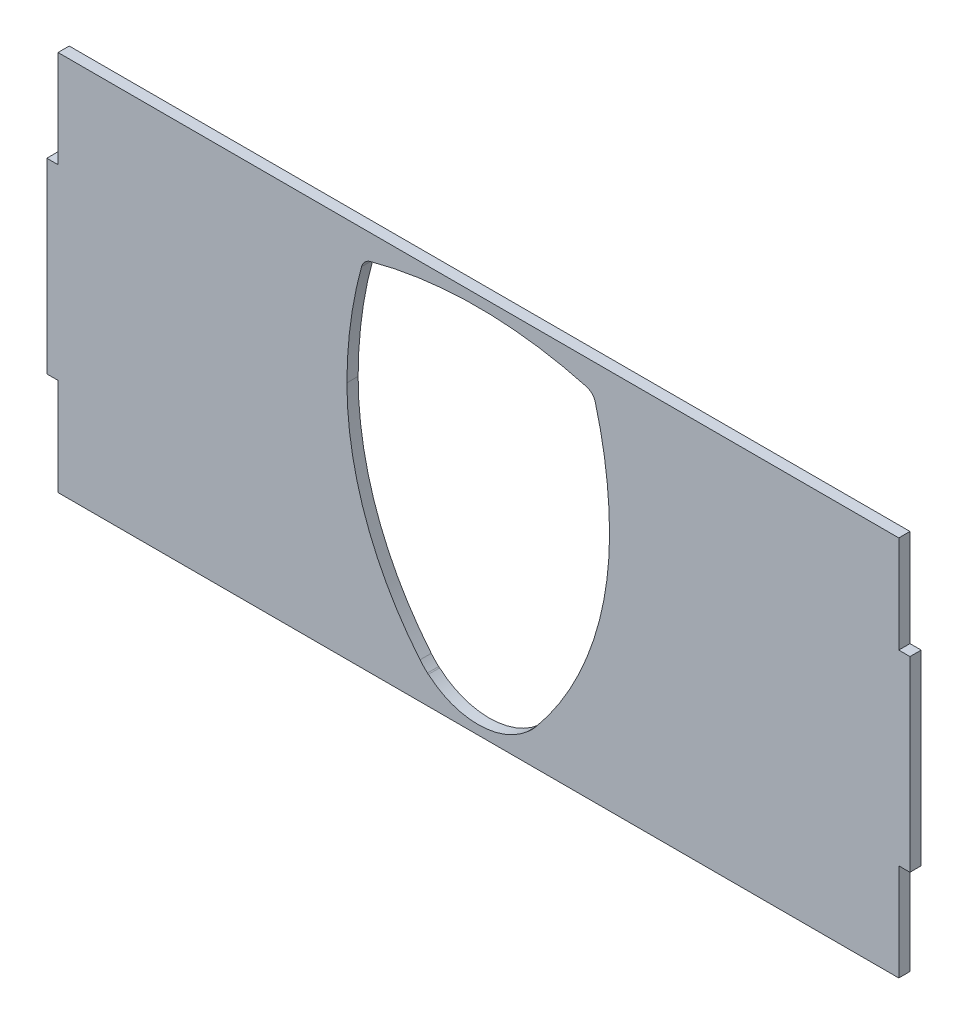
ISO-10303-21;
HEADER;
FILE_DESCRIPTION(('STEP AP214'),'2;1');
FILE_NAME('part.step','',(''),(''),'','','');
FILE_SCHEMA(('AUTOMOTIVE_DESIGN { 1 0 10303 214 1 1 1 1 }'));
ENDSEC;
DATA;
#1=APPLICATION_CONTEXT('core data for automotive mechanical design processes');
#2=APPLICATION_PROTOCOL_DEFINITION('international standard','automotive_design',2000,#1);
#3=PRODUCT_CONTEXT('',#1,'mechanical');
#4=PRODUCT('Part','Part','',(#3));
#5=PRODUCT_RELATED_PRODUCT_CATEGORY('part','',(#4));
#6=PRODUCT_DEFINITION_FORMATION('','',#4);
#7=PRODUCT_DEFINITION_CONTEXT('part definition',#1,'design');
#8=PRODUCT_DEFINITION('design','',#6,#7);
#9=PRODUCT_DEFINITION_SHAPE('','',#8);
#10=(LENGTH_UNIT() NAMED_UNIT(*) SI_UNIT(.MILLI.,.METRE.));
#11=(NAMED_UNIT(*) PLANE_ANGLE_UNIT() SI_UNIT($,.RADIAN.));
#12=(NAMED_UNIT(*) SI_UNIT($,.STERADIAN.) SOLID_ANGLE_UNIT());
#13=UNCERTAINTY_MEASURE_WITH_UNIT(LENGTH_MEASURE(1.E-05),#10,'distance_accuracy_value','');
#14=(GEOMETRIC_REPRESENTATION_CONTEXT(3) GLOBAL_UNCERTAINTY_ASSIGNED_CONTEXT((#13)) GLOBAL_UNIT_ASSIGNED_CONTEXT((#10,
#11,#12)) REPRESENTATION_CONTEXT('',''));
#15=CARTESIAN_POINT('',(0.,0.,0.));
#16=DIRECTION('',(0.,0.,1.));
#17=DIRECTION('',(1.,0.,0.));
#18=AXIS2_PLACEMENT_3D('',#15,#16,#17);
#19=CARTESIAN_POINT('',(0.,0.,3.));
#20=DIRECTION('',(0.,0.,1.));
#21=DIRECTION('',(1.,0.,0.));
#22=AXIS2_PLACEMENT_3D('',#19,#20,#21);
#23=PLANE('',#22);
#24=DIRECTION('',(-1.,0.,0.));
#25=VECTOR('',#24,1.);
#26=CARTESIAN_POINT('',(112.657319819799,49.5841216216235,3.));
#27=LINE('',#26,#25);
#28=CARTESIAN_POINT('',(112.657319819799,49.5841216216235,3.));
#29=VERTEX_POINT('',#28);
#30=CARTESIAN_POINT('',(-112.342680180183,49.5841216216235,3.));
#31=VERTEX_POINT('',#30);
#32=EDGE_CURVE('E290',#29,#31,#27,.T.);
#33=ORIENTED_EDGE('',*,*,#32,.T.);
#34=DIRECTION('',(0.,-1.,0.));
#35=VECTOR('',#34,1.);
#36=CARTESIAN_POINT('',(-112.342680180183,49.5841216216235,3.));
#37=LINE('',#36,#35);
#38=CARTESIAN_POINT('',(-112.342680180183,23.5841216216234,3.));
#39=VERTEX_POINT('',#38);
#40=EDGE_CURVE('E293',#31,#39,#37,.T.);
#41=ORIENTED_EDGE('',*,*,#40,.T.);
#42=DIRECTION('',(-1.,0.,0.));
#43=VECTOR('',#42,1.);
#44=CARTESIAN_POINT('',(-112.342680180183,23.5841216216234,3.));
#45=LINE('',#44,#43);
#46=CARTESIAN_POINT('',(-115.342680180183,23.5841216216234,3.));
#47=VERTEX_POINT('',#46);
#48=EDGE_CURVE('E296',#39,#47,#45,.T.);
#49=ORIENTED_EDGE('',*,*,#48,.T.);
#50=DIRECTION('',(0.,-1.,0.));
#51=VECTOR('',#50,1.);
#52=CARTESIAN_POINT('',(-115.342680180183,23.5841216216234,3.));
#53=LINE('',#52,#51);
#54=CARTESIAN_POINT('',(-115.342680180183,-26.4158783783766,3.));
#55=VERTEX_POINT('',#54);
#56=EDGE_CURVE('E298',#47,#55,#53,.T.);
#57=ORIENTED_EDGE('',*,*,#56,.T.);
#58=DIRECTION('',(1.,0.,0.));
#59=VECTOR('',#58,1.);
#60=CARTESIAN_POINT('',(-115.342680180183,-26.4158783783766,3.));
#61=LINE('',#60,#59);
#62=CARTESIAN_POINT('',(-112.342680180183,-26.4158783783766,3.));
#63=VERTEX_POINT('',#62);
#64=EDGE_CURVE('E300',#55,#63,#61,.T.);
#65=ORIENTED_EDGE('',*,*,#64,.T.);
#66=DIRECTION('',(0.,-1.,0.));
#67=VECTOR('',#66,1.);
#68=CARTESIAN_POINT('',(-112.342680180183,-26.4158783783766,3.));
#69=LINE('',#68,#67);
#70=CARTESIAN_POINT('',(-112.342680180183,-52.4158783783766,3.));
#71=VERTEX_POINT('',#70);
#72=EDGE_CURVE('E302',#63,#71,#69,.T.);
#73=ORIENTED_EDGE('',*,*,#72,.T.);
#74=DIRECTION('',(1.,0.,0.));
#75=VECTOR('',#74,1.);
#76=CARTESIAN_POINT('',(-112.342680180183,-52.4158783783766,3.));
#77=LINE('',#76,#75);
#78=CARTESIAN_POINT('',(112.657319819799,-52.4158783783766,3.));
#79=VERTEX_POINT('',#78);
#80=EDGE_CURVE('E304',#71,#79,#77,.T.);
#81=ORIENTED_EDGE('',*,*,#80,.T.);
#82=DIRECTION('',(0.,1.,0.));
#83=VECTOR('',#82,1.);
#84=CARTESIAN_POINT('',(112.657319819799,-52.4158783783766,3.));
#85=LINE('',#84,#83);
#86=CARTESIAN_POINT('',(112.657319819799,-26.4158783783766,3.));
#87=VERTEX_POINT('',#86);
#88=EDGE_CURVE('E306',#79,#87,#85,.T.);
#89=ORIENTED_EDGE('',*,*,#88,.T.);
#90=DIRECTION('',(1.,0.,0.));
#91=VECTOR('',#90,1.);
#92=CARTESIAN_POINT('',(112.657319819799,-26.4158783783766,3.));
#93=LINE('',#92,#91);
#94=CARTESIAN_POINT('',(115.657319819799,-26.4158783783766,3.));
#95=VERTEX_POINT('',#94);
#96=EDGE_CURVE('E308',#87,#95,#93,.T.);
#97=ORIENTED_EDGE('',*,*,#96,.T.);
#98=DIRECTION('',(0.,1.,0.));
#99=VECTOR('',#98,1.);
#100=CARTESIAN_POINT('',(115.657319819799,-26.4158783783766,3.));
#101=LINE('',#100,#99);
#102=CARTESIAN_POINT('',(115.657319819799,23.5841216216234,3.));
#103=VERTEX_POINT('',#102);
#104=EDGE_CURVE('E310',#95,#103,#101,.T.);
#105=ORIENTED_EDGE('',*,*,#104,.T.);
#106=DIRECTION('',(-1.,0.,0.));
#107=VECTOR('',#106,1.);
#108=CARTESIAN_POINT('',(115.657319819799,23.5841216216234,3.));
#109=LINE('',#108,#107);
#110=CARTESIAN_POINT('',(112.657319819799,23.5841216216234,3.));
#111=VERTEX_POINT('',#110);
#112=EDGE_CURVE('E312',#103,#111,#109,.T.);
#113=ORIENTED_EDGE('',*,*,#112,.T.);
#114=DIRECTION('',(0.,1.,0.));
#115=VECTOR('',#114,1.);
#116=CARTESIAN_POINT('',(112.657319819799,23.5841216216234,3.));
#117=LINE('',#116,#115);
#118=EDGE_CURVE('E314',#111,#29,#117,.T.);
#119=ORIENTED_EDGE('',*,*,#118,.T.);
#120=EDGE_LOOP('',(#33,#41,#49,#57,#65,#73,#81,#89,#97,#105,#113,#119));
#121=FACE_BOUND('',#120,.T.);
#122=CARTESIAN_POINT('',(-27.844748790696,39.6685860086391,3.));
#123=DIRECTION('',(0.,0.,1.));
#124=DIRECTION('',(1.,0.,0.));
#125=AXIS2_PLACEMENT_3D('',#122,#123,#124);
#126=CIRCLE('',#125,3.39034499368492);
#127=CARTESIAN_POINT('',(-28.7319405351346,42.9407916844492,3.));
#128=VERTEX_POINT('',#127);
#129=CARTESIAN_POINT('',(-31.1142632918185,40.5656445926535,3.));
#130=VERTEX_POINT('',#129);
#131=EDGE_CURVE('E219',#128,#130,#126,.T.);
#132=ORIENTED_EDGE('',*,*,#131,.F.);
#133=CARTESIAN_POINT('',(0.000380552190612374,-63.0318627475461,3.));
#134=DIRECTION('',(0.,0.,1.));
#135=DIRECTION('',(1.,0.,0.));
#136=AXIS2_PLACEMENT_3D('',#133,#134,#135);
#137=CIRCLE('',#136,109.798678327329);
#138=CARTESIAN_POINT('',(29.0522460947758,42.853636122336,3.));
#139=VERTEX_POINT('',#138);
#140=EDGE_CURVE('E211',#139,#128,#137,.T.);
#141=ORIENTED_EDGE('',*,*,#140,.F.);
#142=CARTESIAN_POINT('',(28.1551875107582,39.5841216212024,3.));
#143=DIRECTION('',(0.,0.,1.));
#144=DIRECTION('',(1.,0.,0.));
#145=AXIS2_PLACEMENT_3D('',#142,#143,#144);
#146=CIRCLE('',#145,3.39034499369649);
#147=CARTESIAN_POINT('',(31.4273931865795,40.4713133656441,3.));
#148=VERTEX_POINT('',#147);
#149=EDGE_CURVE('E493',#148,#139,#146,.T.);
#150=ORIENTED_EDGE('',*,*,#149,.F.);
#151=CARTESIAN_POINT('',(-74.5452612448646,11.7389922784686,3.));
#152=DIRECTION('',(0.,0.,1.));
#153=DIRECTION('',(1.,0.,0.));
#154=AXIS2_PLACEMENT_3D('',#151,#152,#153);
#155=CIRCLE('',#154,109.798678326758);
#156=CARTESIAN_POINT('',(35.2532921887534,11.5733837407922,3.));
#157=VERTEX_POINT('',#156);
#158=EDGE_CURVE('E490',#157,#148,#155,.T.);
#159=ORIENTED_EDGE('',*,*,#158,.F.);
#160=CARTESIAN_POINT('',(-49.7952893970695,11.7016620357921,3.));
#161=DIRECTION('',(0.,0.,1.));
#162=DIRECTION('',(1.,0.,0.));
#163=AXIS2_PLACEMENT_3D('',#160,#161,#162);
#164=CIRCLE('',#163,85.0486783264816);
#165=CARTESIAN_POINT('',(15.5169623950255,-42.7739054319024,3.));
#166=VERTEX_POINT('',#165);
#167=EDGE_CURVE('E485',#166,#157,#164,.T.);
#168=ORIENTED_EDGE('',*,*,#167,.F.);
#169=CARTESIAN_POINT('',(0.050393022604258,-29.873567130597,3.));
#170=DIRECTION('',(0.,0.,1.));
#171=DIRECTION('',(1.,0.,0.));
#172=AXIS2_PLACEMENT_3D('',#169,#170,#171);
#173=CIRCLE('',#172,20.1403449930741);
#174=CARTESIAN_POINT('',(13.5334638747875,-44.8348604181124,3.));
#175=VERTEX_POINT('',#174);
#176=EDGE_CURVE('E491',#175,#166,#173,.T.);
#177=ORIENTED_EDGE('',*,*,#176,.F.);
#178=CARTESIAN_POINT('',(13.3018521757897,-45.0320379700655,3.));
#179=CARTESIAN_POINT('',(13.3024348241949,-45.0318958874323,3.));
#180=CARTESIAN_POINT('',(13.3035949260665,-45.0316129889856,3.));
#181=CARTESIAN_POINT('',(13.3103455972649,-45.026788399442,3.));
#182=CARTESIAN_POINT('',(13.3274242938413,-45.0135596009868,3.));
#183=CARTESIAN_POINT('',(13.3683734127451,-44.9798067941469,3.));
#184=CARTESIAN_POINT('',(13.4323459069069,-44.9246924333062,3.));
#185=CARTESIAN_POINT('',(13.4892471423503,-44.8745462614262,3.));
#186=CARTESIAN_POINT('',(13.5187325209987,-44.8480822498951,3.));
#187=CARTESIAN_POINT('',(13.5334638747875,-44.8348604181123,3.));
#188=B_SPLINE_CURVE_WITH_KNOTS('',3,(#178,#179,#180,#181,#182,#183,#184,#185,#186,#187),
.UNSPECIFIED.,.F.,.F.,(4,1,1,1,1,1,1,4),(0.,0.0837752115830689,0.166803476814027,
0.250583377539513,0.499711324450385,0.748903892627534,0.874548479203586,1.),.UNSPECIFIED.);
#189=CARTESIAN_POINT('',(13.3018521757897,-45.0320379700655,3.));
#190=VERTEX_POINT('',#189);
#191=EDGE_CURVE('E411',#190,#175,#188,.T.);
#192=ORIENTED_EDGE('',*,*,#191,.F.);
#193=DIRECTION('',(0.765074050634348,-0.643942308787015,0.));
#194=VECTOR('',#193,1.);
#195=CARTESIAN_POINT('',(13.2742862720584,-45.0088364882248,3.));
#196=LINE('',#195,#194);
#197=CARTESIAN_POINT('',(13.2742862720584,-45.0088364882248,3.));
#198=VERTEX_POINT('',#197);
#199=EDGE_CURVE('E465',#198,#190,#196,.T.);
#200=ORIENTED_EDGE('',*,*,#199,.F.);
#201=CARTESIAN_POINT('',(0.0503930225005389,-29.8735671304766,3.));
#202=DIRECTION('',(0.,0.,1.));
#203=DIRECTION('',(1.,0.,0.));
#204=AXIS2_PLACEMENT_3D('',#201,#202,#203);
#205=CIRCLE('',#204,20.0984509653677);
#206=CARTESIAN_POINT('',(-13.2190968383735,-44.9688766681924,3.));
#207=VERTEX_POINT('',#206);
#208=EDGE_CURVE('E243',#207,#198,#205,.T.);
#209=ORIENTED_EDGE('',*,*,#208,.F.);
#210=DIRECTION('',(0.767013074932207,0.641631469679473,0.));
#211=VECTOR('',#210,1.);
#212=CARTESIAN_POINT('',(-13.2467326056978,-44.9919948894895,3.));
#213=LINE('',#212,#211);
#214=CARTESIAN_POINT('',(-13.2467326056978,-44.9919948894895,3.));
#215=VERTEX_POINT('',#214);
#216=EDGE_CURVE('E424',#215,#207,#213,.T.);
#217=ORIENTED_EDGE('',*,*,#216,.F.);
#218=CARTESIAN_POINT('',(-13.4777484486652,-44.7941195590291,3.));
#219=CARTESIAN_POINT('',(-13.4679508773529,-44.8029791960034,3.));
#220=CARTESIAN_POINT('',(-13.4484477294096,-44.8206152820423,3.));
#221=CARTESIAN_POINT('',(-13.4194861810686,-44.8464905821242,3.));
#222=CARTESIAN_POINT('',(-13.3729279053081,-44.8877137208983,3.));
#223=CARTESIAN_POINT('',(-13.3132035276964,-44.9394688904647,3.));
#224=CARTESIAN_POINT('',(-13.2697418079345,-44.9755086750996,3.));
#225=CARTESIAN_POINT('',(-13.2502450478078,-44.9905632488743,3.));
#226=CARTESIAN_POINT('',(-13.2479021024202,-44.9915182128766,3.));
#227=CARTESIAN_POINT('',(-13.2467326056978,-44.9919948894895,3.));
#228=B_SPLINE_CURVE_WITH_KNOTS('',3,(#218,#219,#220,#221,#222,#223,#224,#225,#226,#227),
.UNSPECIFIED.,.F.,.F.,(4,1,1,1,1,1,1,4),(0.,0.0838178623974086,0.166848713677638,
0.250507588760318,0.499664298013625,0.748829296988882,0.874626478483711,1.),.UNSPECIFIED.);
#229=CARTESIAN_POINT('',(-13.4777484486652,-44.7941195590291,3.));
#230=VERTEX_POINT('',#229);
#231=EDGE_CURVE('E422',#230,#215,#228,.T.);
#232=ORIENTED_EDGE('',*,*,#231,.F.);
#233=CARTESIAN_POINT('',(0.0503930225150429,-29.8735671304609,3.));
#234=DIRECTION('',(0.,0.,1.));
#235=DIRECTION('',(1.,0.,0.));
#236=AXIS2_PLACEMENT_3D('',#233,#234,#235);
#237=CIRCLE('',#236,20.1403449930212);
#238=CARTESIAN_POINT('',(-15.4550209048143,-42.727190564345,3.));
#239=VERTEX_POINT('',#238);
#240=EDGE_CURVE('E238',#239,#230,#237,.T.);
#241=ORIENTED_EDGE('',*,*,#240,.F.);
#242=CARTESIAN_POINT('',(50.0212637308231,11.5511092929525,3.));
#243=DIRECTION('',(0.,0.,1.));
#244=DIRECTION('',(1.,0.,0.));
#245=AXIS2_PLACEMENT_3D('',#242,#243,#244);
#246=CIRCLE('',#245,85.0486783265073);
#247=CARTESIAN_POINT('',(-35.0273178550255,11.6793875879523,3.));
#248=VERTEX_POINT('',#247);
#249=EDGE_CURVE('E234',#248,#239,#246,.T.);
#250=ORIENTED_EDGE('',*,*,#249,.F.);
#251=CARTESIAN_POINT('',(74.7712355786984,11.5137790541621,3.));
#252=DIRECTION('',(0.,0.,1.));
#253=DIRECTION('',(1.,0.,0.));
#254=AXIS2_PLACEMENT_3D('',#251,#252,#253);
#255=CIRCLE('',#254,109.798678326858);
#256=EDGE_CURVE('E232',#130,#248,#255,.T.);
#257=ORIENTED_EDGE('',*,*,#256,.F.);
#258=EDGE_LOOP('',(#132,#141,#150,#159,#168,#177,#192,#200,#209,#217,#232,#241,#250,#257));
#259=FACE_BOUND('',#258,.T.);
#260=ADVANCED_FACE('F34',(#121,#259),#23,.T.);
#261=CARTESIAN_POINT('',(0.,0.,0.));
#262=DIRECTION('',(0.,0.,1.));
#263=DIRECTION('',(1.,0.,0.));
#264=AXIS2_PLACEMENT_3D('',#261,#262,#263);
#265=PLANE('',#264);
#266=DIRECTION('',(-1.,0.,0.));
#267=VECTOR('',#266,1.);
#268=CARTESIAN_POINT('',(112.657319819799,49.5841216216235,0.));
#269=LINE('',#268,#267);
#270=CARTESIAN_POINT('',(112.657319819799,49.5841216216235,0.));
#271=VERTEX_POINT('',#270);
#272=CARTESIAN_POINT('',(-112.342680180183,49.5841216216235,0.));
#273=VERTEX_POINT('',#272);
#274=EDGE_CURVE('E227',#271,#273,#269,.T.);
#275=ORIENTED_EDGE('',*,*,#274,.F.);
#276=DIRECTION('',(0.,1.,0.));
#277=VECTOR('',#276,1.);
#278=CARTESIAN_POINT('',(112.657319819799,23.5841216216234,0.));
#279=LINE('',#278,#277);
#280=CARTESIAN_POINT('',(112.657319819799,23.5841216216234,0.));
#281=VERTEX_POINT('',#280);
#282=EDGE_CURVE('E294',#281,#271,#279,.T.);
#283=ORIENTED_EDGE('',*,*,#282,.F.);
#284=DIRECTION('',(-1.,0.,0.));
#285=VECTOR('',#284,1.);
#286=CARTESIAN_POINT('',(115.657319819799,23.5841216216234,0.));
#287=LINE('',#286,#285);
#288=CARTESIAN_POINT('',(115.657319819799,23.5841216216234,0.));
#289=VERTEX_POINT('',#288);
#290=EDGE_CURVE('E337',#289,#281,#287,.T.);
#291=ORIENTED_EDGE('',*,*,#290,.F.);
#292=DIRECTION('',(0.,1.,0.));
#293=VECTOR('',#292,1.);
#294=CARTESIAN_POINT('',(115.657319819799,-26.4158783783766,0.));
#295=LINE('',#294,#293);
#296=CARTESIAN_POINT('',(115.657319819799,-26.4158783783766,0.));
#297=VERTEX_POINT('',#296);
#298=EDGE_CURVE('E335',#297,#289,#295,.T.);
#299=ORIENTED_EDGE('',*,*,#298,.F.);
#300=DIRECTION('',(1.,0.,0.));
#301=VECTOR('',#300,1.);
#302=CARTESIAN_POINT('',(112.657319819799,-26.4158783783766,0.));
#303=LINE('',#302,#301);
#304=CARTESIAN_POINT('',(112.657319819799,-26.4158783783766,0.));
#305=VERTEX_POINT('',#304);
#306=EDGE_CURVE('E333',#305,#297,#303,.T.);
#307=ORIENTED_EDGE('',*,*,#306,.F.);
#308=DIRECTION('',(0.,1.,0.));
#309=VECTOR('',#308,1.);
#310=CARTESIAN_POINT('',(112.657319819799,-52.4158783783766,0.));
#311=LINE('',#310,#309);
#312=CARTESIAN_POINT('',(112.657319819799,-52.4158783783766,0.));
#313=VERTEX_POINT('',#312);
#314=EDGE_CURVE('E331',#313,#305,#311,.T.);
#315=ORIENTED_EDGE('',*,*,#314,.F.);
#316=DIRECTION('',(1.,0.,0.));
#317=VECTOR('',#316,1.);
#318=CARTESIAN_POINT('',(-112.342680180183,-52.4158783783766,0.));
#319=LINE('',#318,#317);
#320=CARTESIAN_POINT('',(-112.342680180183,-52.4158783783766,0.));
#321=VERTEX_POINT('',#320);
#322=EDGE_CURVE('E329',#321,#313,#319,.T.);
#323=ORIENTED_EDGE('',*,*,#322,.F.);
#324=DIRECTION('',(0.,-1.,0.));
#325=VECTOR('',#324,1.);
#326=CARTESIAN_POINT('',(-112.342680180183,-26.4158783783766,0.));
#327=LINE('',#326,#325);
#328=CARTESIAN_POINT('',(-112.342680180183,-26.4158783783766,0.));
#329=VERTEX_POINT('',#328);
#330=EDGE_CURVE('E327',#329,#321,#327,.T.);
#331=ORIENTED_EDGE('',*,*,#330,.F.);
#332=DIRECTION('',(1.,0.,0.));
#333=VECTOR('',#332,1.);
#334=CARTESIAN_POINT('',(-115.342680180183,-26.4158783783766,0.));
#335=LINE('',#334,#333);
#336=CARTESIAN_POINT('',(-115.342680180183,-26.4158783783766,0.));
#337=VERTEX_POINT('',#336);
#338=EDGE_CURVE('E325',#337,#329,#335,.T.);
#339=ORIENTED_EDGE('',*,*,#338,.F.);
#340=DIRECTION('',(0.,-1.,0.));
#341=VECTOR('',#340,1.);
#342=CARTESIAN_POINT('',(-115.342680180183,23.5841216216234,0.));
#343=LINE('',#342,#341);
#344=CARTESIAN_POINT('',(-115.342680180183,23.5841216216234,0.));
#345=VERTEX_POINT('',#344);
#346=EDGE_CURVE('E323',#345,#337,#343,.T.);
#347=ORIENTED_EDGE('',*,*,#346,.F.);
#348=DIRECTION('',(-1.,0.,0.));
#349=VECTOR('',#348,1.);
#350=CARTESIAN_POINT('',(-112.342680180183,23.5841216216234,0.));
#351=LINE('',#350,#349);
#352=CARTESIAN_POINT('',(-112.342680180183,23.5841216216234,0.));
#353=VERTEX_POINT('',#352);
#354=EDGE_CURVE('E321',#353,#345,#351,.T.);
#355=ORIENTED_EDGE('',*,*,#354,.F.);
#356=DIRECTION('',(0.,-1.,0.));
#357=VECTOR('',#356,1.);
#358=CARTESIAN_POINT('',(-112.342680180183,49.5841216216235,0.));
#359=LINE('',#358,#357);
#360=EDGE_CURVE('E319',#273,#353,#359,.T.);
#361=ORIENTED_EDGE('',*,*,#360,.F.);
#362=EDGE_LOOP('',(#275,#283,#291,#299,#307,#315,#323,#331,#339,#347,#355,#361));
#363=FACE_BOUND('',#362,.T.);
#364=CARTESIAN_POINT('',(0.000380552190612374,-63.0318627475461,0.));
#365=DIRECTION('',(0.,0.,1.));
#366=DIRECTION('',(1.,0.,0.));
#367=AXIS2_PLACEMENT_3D('',#364,#365,#366);
#368=CIRCLE('',#367,109.798678327329);
#369=CARTESIAN_POINT('',(29.0522460947758,42.853636122336,0.));
#370=VERTEX_POINT('',#369);
#371=CARTESIAN_POINT('',(-28.7319405351346,42.9407916844492,0.));
#372=VERTEX_POINT('',#371);
#373=EDGE_CURVE('E61',#370,#372,#368,.T.);
#374=ORIENTED_EDGE('',*,*,#373,.T.);
#375=CARTESIAN_POINT('',(-27.844748790696,39.6685860086391,0.));
#376=DIRECTION('',(0.,0.,1.));
#377=DIRECTION('',(1.,0.,0.));
#378=AXIS2_PLACEMENT_3D('',#375,#376,#377);
#379=CIRCLE('',#378,3.39034499368492);
#380=CARTESIAN_POINT('',(-31.1142632918185,40.5656445926535,0.));
#381=VERTEX_POINT('',#380);
#382=EDGE_CURVE('E226',#372,#381,#379,.T.);
#383=ORIENTED_EDGE('',*,*,#382,.T.);
#384=CARTESIAN_POINT('',(74.7712355786984,11.5137790541621,0.));
#385=DIRECTION('',(0.,0.,1.));
#386=DIRECTION('',(1.,0.,0.));
#387=AXIS2_PLACEMENT_3D('',#384,#385,#386);
#388=CIRCLE('',#387,109.798678326858);
#389=CARTESIAN_POINT('',(-35.0273178550255,11.6793875879523,0.));
#390=VERTEX_POINT('',#389);
#391=EDGE_CURVE('E497',#381,#390,#388,.T.);
#392=ORIENTED_EDGE('',*,*,#391,.T.);
#393=CARTESIAN_POINT('',(50.0212637308231,11.5511092929525,0.));
#394=DIRECTION('',(0.,0.,1.));
#395=DIRECTION('',(1.,0.,0.));
#396=AXIS2_PLACEMENT_3D('',#393,#394,#395);
#397=CIRCLE('',#396,85.0486783265073);
#398=CARTESIAN_POINT('',(-15.4550209048143,-42.727190564345,0.));
#399=VERTEX_POINT('',#398);
#400=EDGE_CURVE('E281',#390,#399,#397,.T.);
#401=ORIENTED_EDGE('',*,*,#400,.T.);
#402=CARTESIAN_POINT('',(0.0503930225150429,-29.8735671304609,0.));
#403=DIRECTION('',(0.,0.,1.));
#404=DIRECTION('',(1.,0.,0.));
#405=AXIS2_PLACEMENT_3D('',#402,#403,#404);
#406=CIRCLE('',#405,20.1403449930212);
#407=CARTESIAN_POINT('',(-13.4777484486652,-44.7941195590291,0.));
#408=VERTEX_POINT('',#407);
#409=EDGE_CURVE('E272',#399,#408,#406,.T.);
#410=ORIENTED_EDGE('',*,*,#409,.T.);
#411=CARTESIAN_POINT('',(-13.2467326056978,-44.9919948894895,0.));
#412=CARTESIAN_POINT('',(-13.2479021024202,-44.9915182128766,0.));
#413=CARTESIAN_POINT('',(-13.2502450478078,-44.9905632488743,0.));
#414=CARTESIAN_POINT('',(-13.2697418079345,-44.9755086750996,0.));
#415=CARTESIAN_POINT('',(-13.3132035276964,-44.9394688904647,0.));
#416=CARTESIAN_POINT('',(-13.3729279053081,-44.8877137208983,0.));
#417=CARTESIAN_POINT('',(-13.4194861810686,-44.8464905821242,0.));
#418=CARTESIAN_POINT('',(-13.4484477294096,-44.8206152820423,0.));
#419=CARTESIAN_POINT('',(-13.4679508773529,-44.8029791960034,0.));
#420=CARTESIAN_POINT('',(-13.4777484486652,-44.7941195590291,0.));
#421=B_SPLINE_CURVE_WITH_KNOTS('',3,(#411,#412,#413,#414,#415,#416,#417,#418,#419,#420),
.UNSPECIFIED.,.F.,.F.,(4,1,1,1,1,1,1,4),(0.,0.125373521516289,0.251170703011118,
0.500335701986375,0.749492411239682,0.833151286322362,0.916182137602591,1.),.UNSPECIFIED.);
#422=CARTESIAN_POINT('',(-13.2467326056978,-44.9919948894895,0.));
#423=VERTEX_POINT('',#422);
#424=EDGE_CURVE('E280',#408,#423,#421,.F.);
#425=ORIENTED_EDGE('',*,*,#424,.T.);
#426=DIRECTION('',(0.767013074932207,0.641631469679473,0.));
#427=VECTOR('',#426,1.);
#428=CARTESIAN_POINT('',(-13.2467326056978,-44.9919948894895,0.));
#429=LINE('',#428,#427);
#430=CARTESIAN_POINT('',(-13.2190968383735,-44.9688766681924,0.));
#431=VERTEX_POINT('',#430);
#432=EDGE_CURVE('E284',#423,#431,#429,.T.);
#433=ORIENTED_EDGE('',*,*,#432,.T.);
#434=CARTESIAN_POINT('',(0.0503930225005389,-29.8735671304766,0.));
#435=DIRECTION('',(0.,0.,1.));
#436=DIRECTION('',(1.,0.,0.));
#437=AXIS2_PLACEMENT_3D('',#434,#435,#436);
#438=CIRCLE('',#437,20.0984509653677);
#439=CARTESIAN_POINT('',(13.2742862720584,-45.0088364882248,0.));
#440=VERTEX_POINT('',#439);
#441=EDGE_CURVE('E287',#431,#440,#438,.T.);
#442=ORIENTED_EDGE('',*,*,#441,.T.);
#443=DIRECTION('',(0.765074050634348,-0.643942308787015,0.));
#444=VECTOR('',#443,1.);
#445=CARTESIAN_POINT('',(13.2742862720584,-45.0088364882248,0.));
#446=LINE('',#445,#444);
#447=CARTESIAN_POINT('',(13.3018521757897,-45.0320379700655,0.));
#448=VERTEX_POINT('',#447);
#449=EDGE_CURVE('E504',#440,#448,#446,.T.);
#450=ORIENTED_EDGE('',*,*,#449,.T.);
#451=CARTESIAN_POINT('',(13.5334638747875,-44.8348604181123,0.));
#452=CARTESIAN_POINT('',(13.5187325209987,-44.8480822498951,0.));
#453=CARTESIAN_POINT('',(13.4892471423503,-44.8745462614262,0.));
#454=CARTESIAN_POINT('',(13.4323459069069,-44.9246924333062,0.));
#455=CARTESIAN_POINT('',(13.3683734127451,-44.9798067941469,0.));
#456=CARTESIAN_POINT('',(13.3274242938413,-45.0135596009868,0.));
#457=CARTESIAN_POINT('',(13.3103455972649,-45.026788399442,0.));
#458=CARTESIAN_POINT('',(13.3035949260665,-45.0316129889856,0.));
#459=CARTESIAN_POINT('',(13.3024348241949,-45.0318958874323,0.));
#460=CARTESIAN_POINT('',(13.3018521757897,-45.0320379700655,0.));
#461=B_SPLINE_CURVE_WITH_KNOTS('',3,(#451,#452,#453,#454,#455,#456,#457,#458,#459,#460),
.UNSPECIFIED.,.F.,.F.,(4,1,1,1,1,1,1,4),(0.,0.125451520796414,0.251096107372466,
0.500288675549615,0.749416622460487,0.833196523185973,0.916224788416931,1.),.UNSPECIFIED.);
#462=CARTESIAN_POINT('',(13.5334638747875,-44.8348604181124,0.));
#463=VERTEX_POINT('',#462);
#464=EDGE_CURVE('E377',#448,#463,#461,.F.);
#465=ORIENTED_EDGE('',*,*,#464,.T.);
#466=CARTESIAN_POINT('',(0.050393022604258,-29.873567130597,0.));
#467=DIRECTION('',(0.,0.,1.));
#468=DIRECTION('',(1.,0.,0.));
#469=AXIS2_PLACEMENT_3D('',#466,#467,#468);
#470=CIRCLE('',#469,20.1403449930741);
#471=CARTESIAN_POINT('',(15.5169623950255,-42.7739054319024,0.));
#472=VERTEX_POINT('',#471);
#473=EDGE_CURVE('E509',#463,#472,#470,.T.);
#474=ORIENTED_EDGE('',*,*,#473,.T.);
#475=CARTESIAN_POINT('',(-49.7952893970695,11.7016620357921,0.));
#476=DIRECTION('',(0.,0.,1.));
#477=DIRECTION('',(1.,0.,0.));
#478=AXIS2_PLACEMENT_3D('',#475,#476,#477);
#479=CIRCLE('',#478,85.0486783264816);
#480=CARTESIAN_POINT('',(35.2532921887534,11.5733837407922,0.));
#481=VERTEX_POINT('',#480);
#482=EDGE_CURVE('E505',#472,#481,#479,.T.);
#483=ORIENTED_EDGE('',*,*,#482,.T.);
#484=CARTESIAN_POINT('',(-74.5452612448646,11.7389922784686,0.));
#485=DIRECTION('',(0.,0.,1.));
#486=DIRECTION('',(1.,0.,0.));
#487=AXIS2_PLACEMENT_3D('',#484,#485,#486);
#488=CIRCLE('',#487,109.798678326758);
#489=CARTESIAN_POINT('',(31.4273931865795,40.4713133656441,0.));
#490=VERTEX_POINT('',#489);
#491=EDGE_CURVE('E508',#481,#490,#488,.T.);
#492=ORIENTED_EDGE('',*,*,#491,.T.);
#493=CARTESIAN_POINT('',(28.1551875107582,39.5841216212024,0.));
#494=DIRECTION('',(0.,0.,1.));
#495=DIRECTION('',(1.,0.,0.));
#496=AXIS2_PLACEMENT_3D('',#493,#494,#495);
#497=CIRCLE('',#496,3.39034499369649);
#498=EDGE_CURVE('E220',#490,#370,#497,.T.);
#499=ORIENTED_EDGE('',*,*,#498,.T.);
#500=EDGE_LOOP('',(#374,#383,#392,#401,#410,#425,#433,#442,#450,#465,#474,#483,#492,#499));
#501=FACE_BOUND('',#500,.T.);
#502=ADVANCED_FACE('F384',(#363,#501),#265,.F.);
#503=CARTESIAN_POINT('',(112.657319819799,49.5841216216235,3.));
#504=DIRECTION('',(0.,-1.,0.));
#505=DIRECTION('',(1.,0.,0.));
#506=AXIS2_PLACEMENT_3D('',#503,#504,#505);
#507=PLANE('',#506);
#508=ORIENTED_EDGE('',*,*,#274,.T.);
#509=DIRECTION('',(0.,0.,-1.));
#510=VECTOR('',#509,1.);
#511=CARTESIAN_POINT('',(-112.342680180183,49.5841216216235,3.));
#512=LINE('',#511,#510);
#513=EDGE_CURVE('E11',#31,#273,#512,.T.);
#514=ORIENTED_EDGE('',*,*,#513,.F.);
#515=ORIENTED_EDGE('',*,*,#32,.F.);
#516=DIRECTION('',(0.,0.,-1.));
#517=VECTOR('',#516,1.);
#518=CARTESIAN_POINT('',(112.657319819799,49.5841216216235,3.));
#519=LINE('',#518,#517);
#520=EDGE_CURVE('E316',#29,#271,#519,.T.);
#521=ORIENTED_EDGE('',*,*,#520,.T.);
#522=EDGE_LOOP('',(#508,#514,#515,#521));
#523=FACE_BOUND('',#522,.T.);
#524=ADVANCED_FACE('F36',(#523),#507,.F.);
#525=CARTESIAN_POINT('',(-112.342680180183,49.5841216216235,3.));
#526=DIRECTION('',(1.,0.,0.));
#527=DIRECTION('',(0.,0.,-1.));
#528=AXIS2_PLACEMENT_3D('',#525,#526,#527);
#529=PLANE('',#528);
#530=ORIENTED_EDGE('',*,*,#360,.T.);
#531=DIRECTION('',(0.,0.,-1.));
#532=VECTOR('',#531,1.);
#533=CARTESIAN_POINT('',(-112.342680180183,23.5841216216234,3.));
#534=LINE('',#533,#532);
#535=EDGE_CURVE('E45',#39,#353,#534,.T.);
#536=ORIENTED_EDGE('',*,*,#535,.F.);
#537=ORIENTED_EDGE('',*,*,#40,.F.);
#538=ORIENTED_EDGE('',*,*,#513,.T.);
#539=EDGE_LOOP('',(#530,#536,#537,#538));
#540=FACE_BOUND('',#539,.T.);
#541=ADVANCED_FACE('F574',(#540),#529,.F.);
#542=CARTESIAN_POINT('',(-112.342680180183,23.5841216216234,3.));
#543=DIRECTION('',(0.,-1.,0.));
#544=DIRECTION('',(1.,0.,0.));
#545=AXIS2_PLACEMENT_3D('',#542,#543,#544);
#546=PLANE('',#545);
#547=ORIENTED_EDGE('',*,*,#354,.T.);
#548=DIRECTION('',(0.,0.,-1.));
#549=VECTOR('',#548,1.);
#550=CARTESIAN_POINT('',(-115.342680180183,23.5841216216234,3.));
#551=LINE('',#550,#549);
#552=EDGE_CURVE('E366',#47,#345,#551,.T.);
#553=ORIENTED_EDGE('',*,*,#552,.F.);
#554=ORIENTED_EDGE('',*,*,#48,.F.);
#555=ORIENTED_EDGE('',*,*,#535,.T.);
#556=EDGE_LOOP('',(#547,#553,#554,#555));
#557=FACE_BOUND('',#556,.T.);
#558=ADVANCED_FACE('F579',(#557),#546,.F.);
#559=CARTESIAN_POINT('',(-115.342680180183,23.5841216216234,3.));
#560=DIRECTION('',(1.,0.,0.));
#561=DIRECTION('',(0.,0.,-1.));
#562=AXIS2_PLACEMENT_3D('',#559,#560,#561);
#563=PLANE('',#562);
#564=ORIENTED_EDGE('',*,*,#346,.T.);
#565=DIRECTION('',(0.,0.,-1.));
#566=VECTOR('',#565,1.);
#567=CARTESIAN_POINT('',(-115.342680180183,-26.4158783783766,3.));
#568=LINE('',#567,#566);
#569=EDGE_CURVE('E363',#55,#337,#568,.T.);
#570=ORIENTED_EDGE('',*,*,#569,.F.);
#571=ORIENTED_EDGE('',*,*,#56,.F.);
#572=ORIENTED_EDGE('',*,*,#552,.T.);
#573=EDGE_LOOP('',(#564,#570,#571,#572));
#574=FACE_BOUND('',#573,.T.);
#575=ADVANCED_FACE('F585',(#574),#563,.F.);
#576=CARTESIAN_POINT('',(-115.342680180183,-26.4158783783766,3.));
#577=DIRECTION('',(0.,1.,0.));
#578=DIRECTION('',(-1.,0.,0.));
#579=AXIS2_PLACEMENT_3D('',#576,#577,#578);
#580=PLANE('',#579);
#581=ORIENTED_EDGE('',*,*,#338,.T.);
#582=DIRECTION('',(0.,0.,-1.));
#583=VECTOR('',#582,1.);
#584=CARTESIAN_POINT('',(-112.342680180183,-26.4158783783766,3.));
#585=LINE('',#584,#583);
#586=EDGE_CURVE('E360',#63,#329,#585,.T.);
#587=ORIENTED_EDGE('',*,*,#586,.F.);
#588=ORIENTED_EDGE('',*,*,#64,.F.);
#589=ORIENTED_EDGE('',*,*,#569,.T.);
#590=EDGE_LOOP('',(#581,#587,#588,#589));
#591=FACE_BOUND('',#590,.T.);
#592=ADVANCED_FACE('F589',(#591),#580,.F.);
#593=CARTESIAN_POINT('',(-112.342680180183,-26.4158783783766,3.));
#594=DIRECTION('',(1.,0.,0.));
#595=DIRECTION('',(0.,1.,0.));
#596=AXIS2_PLACEMENT_3D('',#593,#594,#595);
#597=PLANE('',#596);
#598=ORIENTED_EDGE('',*,*,#330,.T.);
#599=DIRECTION('',(0.,0.,-1.));
#600=VECTOR('',#599,1.);
#601=CARTESIAN_POINT('',(-112.342680180183,-52.4158783783766,3.));
#602=LINE('',#601,#600);
#603=EDGE_CURVE('E357',#71,#321,#602,.T.);
#604=ORIENTED_EDGE('',*,*,#603,.F.);
#605=ORIENTED_EDGE('',*,*,#72,.F.);
#606=ORIENTED_EDGE('',*,*,#586,.T.);
#607=EDGE_LOOP('',(#598,#604,#605,#606));
#608=FACE_BOUND('',#607,.T.);
#609=ADVANCED_FACE('F594',(#608),#597,.F.);
#610=CARTESIAN_POINT('',(-112.342680180183,-52.4158783783766,3.));
#611=DIRECTION('',(0.,1.,0.));
#612=DIRECTION('',(0.,0.,1.));
#613=AXIS2_PLACEMENT_3D('',#610,#611,#612);
#614=PLANE('',#613);
#615=ORIENTED_EDGE('',*,*,#322,.T.);
#616=DIRECTION('',(0.,0.,-1.));
#617=VECTOR('',#616,1.);
#618=CARTESIAN_POINT('',(112.657319819799,-52.4158783783766,3.));
#619=LINE('',#618,#617);
#620=EDGE_CURVE('E354',#79,#313,#619,.T.);
#621=ORIENTED_EDGE('',*,*,#620,.F.);
#622=ORIENTED_EDGE('',*,*,#80,.F.);
#623=ORIENTED_EDGE('',*,*,#603,.T.);
#624=EDGE_LOOP('',(#615,#621,#622,#623));
#625=FACE_BOUND('',#624,.T.);
#626=ADVANCED_FACE('F600',(#625),#614,.F.);
#627=CARTESIAN_POINT('',(112.657319819799,-52.4158783783766,3.));
#628=DIRECTION('',(-1.,0.,0.));
#629=DIRECTION('',(0.,0.,1.));
#630=AXIS2_PLACEMENT_3D('',#627,#628,#629);
#631=PLANE('',#630);
#632=ORIENTED_EDGE('',*,*,#314,.T.);
#633=DIRECTION('',(0.,0.,-1.));
#634=VECTOR('',#633,1.);
#635=CARTESIAN_POINT('',(112.657319819799,-26.4158783783766,3.));
#636=LINE('',#635,#634);
#637=EDGE_CURVE('E351',#87,#305,#636,.T.);
#638=ORIENTED_EDGE('',*,*,#637,.F.);
#639=ORIENTED_EDGE('',*,*,#88,.F.);
#640=ORIENTED_EDGE('',*,*,#620,.T.);
#641=EDGE_LOOP('',(#632,#638,#639,#640));
#642=FACE_BOUND('',#641,.T.);
#643=ADVANCED_FACE('F604',(#642),#631,.F.);
#644=CARTESIAN_POINT('',(112.657319819799,-26.4158783783766,3.));
#645=DIRECTION('',(0.,1.,0.));
#646=DIRECTION('',(-1.,0.,0.));
#647=AXIS2_PLACEMENT_3D('',#644,#645,#646);
#648=PLANE('',#647);
#649=ORIENTED_EDGE('',*,*,#306,.T.);
#650=DIRECTION('',(0.,0.,-1.));
#651=VECTOR('',#650,1.);
#652=CARTESIAN_POINT('',(115.657319819799,-26.4158783783766,3.));
#653=LINE('',#652,#651);
#654=EDGE_CURVE('E348',#95,#297,#653,.T.);
#655=ORIENTED_EDGE('',*,*,#654,.F.);
#656=ORIENTED_EDGE('',*,*,#96,.F.);
#657=ORIENTED_EDGE('',*,*,#637,.T.);
#658=EDGE_LOOP('',(#649,#655,#656,#657));
#659=FACE_BOUND('',#658,.T.);
#660=ADVANCED_FACE('F609',(#659),#648,.F.);
#661=CARTESIAN_POINT('',(115.657319819799,-26.4158783783766,3.));
#662=DIRECTION('',(-1.,0.,0.));
#663=DIRECTION('',(0.,0.,1.));
#664=AXIS2_PLACEMENT_3D('',#661,#662,#663);
#665=PLANE('',#664);
#666=ORIENTED_EDGE('',*,*,#298,.T.);
#667=DIRECTION('',(0.,0.,-1.));
#668=VECTOR('',#667,1.);
#669=CARTESIAN_POINT('',(115.657319819799,23.5841216216234,3.));
#670=LINE('',#669,#668);
#671=EDGE_CURVE('E345',#103,#289,#670,.T.);
#672=ORIENTED_EDGE('',*,*,#671,.F.);
#673=ORIENTED_EDGE('',*,*,#104,.F.);
#674=ORIENTED_EDGE('',*,*,#654,.T.);
#675=EDGE_LOOP('',(#666,#672,#673,#674));
#676=FACE_BOUND('',#675,.T.);
#677=ADVANCED_FACE('F615',(#676),#665,.F.);
#678=CARTESIAN_POINT('',(115.657319819799,23.5841216216234,3.));
#679=DIRECTION('',(0.,-1.,0.));
#680=DIRECTION('',(1.,0.,0.));
#681=AXIS2_PLACEMENT_3D('',#678,#679,#680);
#682=PLANE('',#681);
#683=ORIENTED_EDGE('',*,*,#290,.T.);
#684=DIRECTION('',(0.,0.,-1.));
#685=VECTOR('',#684,1.);
#686=CARTESIAN_POINT('',(112.657319819799,23.5841216216234,3.));
#687=LINE('',#686,#685);
#688=EDGE_CURVE('E342',#111,#281,#687,.T.);
#689=ORIENTED_EDGE('',*,*,#688,.F.);
#690=ORIENTED_EDGE('',*,*,#112,.F.);
#691=ORIENTED_EDGE('',*,*,#671,.T.);
#692=EDGE_LOOP('',(#683,#689,#690,#691));
#693=FACE_BOUND('',#692,.T.);
#694=ADVANCED_FACE('F619',(#693),#682,.F.);
#695=CARTESIAN_POINT('',(112.657319819799,23.5841216216234,3.));
#696=DIRECTION('',(-1.,0.,0.));
#697=DIRECTION('',(0.,0.,1.));
#698=AXIS2_PLACEMENT_3D('',#695,#696,#697);
#699=PLANE('',#698);
#700=ORIENTED_EDGE('',*,*,#282,.T.);
#701=ORIENTED_EDGE('',*,*,#520,.F.);
#702=ORIENTED_EDGE('',*,*,#118,.F.);
#703=ORIENTED_EDGE('',*,*,#688,.T.);
#704=EDGE_LOOP('',(#700,#701,#702,#703));
#705=FACE_BOUND('',#704,.T.);
#706=ADVANCED_FACE('F396',(#705),#699,.F.);
#707=CARTESIAN_POINT('',(0.000380552190612374,-63.0318627475461,3.));
#708=DIRECTION('',(0.,0.,-1.));
#709=DIRECTION('',(-1.,0.,0.));
#710=AXIS2_PLACEMENT_3D('',#707,#708,#709);
#711=CYLINDRICAL_SURFACE('',#710,109.798678327329);
#712=ORIENTED_EDGE('',*,*,#373,.F.);
#713=DIRECTION('',(0.,0.,-1.));
#714=VECTOR('',#713,1.);
#715=CARTESIAN_POINT('',(29.0522460947758,42.853636122336,3.));
#716=LINE('',#715,#714);
#717=EDGE_CURVE('E215',#139,#370,#716,.T.);
#718=ORIENTED_EDGE('',*,*,#717,.F.);
#719=ORIENTED_EDGE('',*,*,#140,.T.);
#720=DIRECTION('',(0.,0.,-1.));
#721=VECTOR('',#720,1.);
#722=CARTESIAN_POINT('',(-28.7319405351346,42.9407916844492,3.));
#723=LINE('',#722,#721);
#724=EDGE_CURVE('E214',#128,#372,#723,.T.);
#725=ORIENTED_EDGE('',*,*,#724,.T.);
#726=EDGE_LOOP('',(#712,#718,#719,#725));
#727=FACE_BOUND('',#726,.T.);
#728=ADVANCED_FACE('F213',(#727),#711,.F.);
#729=CARTESIAN_POINT('',(-27.844748790696,39.6685860086391,3.));
#730=DIRECTION('',(0.,0.,-1.));
#731=DIRECTION('',(-1.,0.,0.));
#732=AXIS2_PLACEMENT_3D('',#729,#730,#731);
#733=CYLINDRICAL_SURFACE('',#732,3.39034499368492);
#734=ORIENTED_EDGE('',*,*,#382,.F.);
#735=ORIENTED_EDGE('',*,*,#724,.F.);
#736=ORIENTED_EDGE('',*,*,#131,.T.);
#737=DIRECTION('',(0.,0.,-1.));
#738=VECTOR('',#737,1.);
#739=CARTESIAN_POINT('',(-31.1142632918185,40.5656445926535,3.));
#740=LINE('',#739,#738);
#741=EDGE_CURVE('E228',#130,#381,#740,.T.);
#742=ORIENTED_EDGE('',*,*,#741,.T.);
#743=EDGE_LOOP('',(#734,#735,#736,#742));
#744=FACE_BOUND('',#743,.T.);
#745=ADVANCED_FACE('F223',(#744),#733,.F.);
#746=CARTESIAN_POINT('',(74.7712355786984,11.5137790541621,3.));
#747=DIRECTION('',(0.,0.,-1.));
#748=DIRECTION('',(-1.,0.,0.));
#749=AXIS2_PLACEMENT_3D('',#746,#747,#748);
#750=CYLINDRICAL_SURFACE('',#749,109.798678326858);
#751=ORIENTED_EDGE('',*,*,#391,.F.);
#752=ORIENTED_EDGE('',*,*,#741,.F.);
#753=ORIENTED_EDGE('',*,*,#256,.T.);
#754=DIRECTION('',(0.,0.,-1.));
#755=VECTOR('',#754,1.);
#756=CARTESIAN_POINT('',(-35.0273178550255,11.6793875879523,3.));
#757=LINE('',#756,#755);
#758=EDGE_CURVE('E454',#248,#390,#757,.T.);
#759=ORIENTED_EDGE('',*,*,#758,.T.);
#760=EDGE_LOOP('',(#751,#752,#753,#759));
#761=FACE_BOUND('',#760,.T.);
#762=ADVANCED_FACE('F728',(#761),#750,.F.);
#763=CARTESIAN_POINT('',(50.0212637308231,11.5511092929525,3.));
#764=DIRECTION('',(0.,0.,-1.));
#765=DIRECTION('',(-1.,0.,0.));
#766=AXIS2_PLACEMENT_3D('',#763,#764,#765);
#767=CYLINDRICAL_SURFACE('',#766,85.0486783265073);
#768=ORIENTED_EDGE('',*,*,#400,.F.);
#769=ORIENTED_EDGE('',*,*,#758,.F.);
#770=ORIENTED_EDGE('',*,*,#249,.T.);
#771=DIRECTION('',(0.,0.,-1.));
#772=VECTOR('',#771,1.);
#773=CARTESIAN_POINT('',(-15.4550209048143,-42.727190564345,3.));
#774=LINE('',#773,#772);
#775=EDGE_CURVE('E435',#239,#399,#774,.T.);
#776=ORIENTED_EDGE('',*,*,#775,.T.);
#777=EDGE_LOOP('',(#768,#769,#770,#776));
#778=FACE_BOUND('',#777,.T.);
#779=ADVANCED_FACE('F736',(#778),#767,.F.);
#780=CARTESIAN_POINT('',(0.0503930225150429,-29.8735671304609,3.));
#781=DIRECTION('',(0.,0.,-1.));
#782=DIRECTION('',(-1.,0.,0.));
#783=AXIS2_PLACEMENT_3D('',#780,#781,#782);
#784=CYLINDRICAL_SURFACE('',#783,20.1403449930212);
#785=ORIENTED_EDGE('',*,*,#409,.F.);
#786=ORIENTED_EDGE('',*,*,#775,.F.);
#787=ORIENTED_EDGE('',*,*,#240,.T.);
#788=DIRECTION('',(0.,0.,-1.));
#789=VECTOR('',#788,1.);
#790=CARTESIAN_POINT('',(-13.4777484486652,-44.7941195590291,3.));
#791=LINE('',#790,#789);
#792=EDGE_CURVE('E433',#230,#408,#791,.T.);
#793=ORIENTED_EDGE('',*,*,#792,.T.);
#794=EDGE_LOOP('',(#785,#786,#787,#793));
#795=FACE_BOUND('',#794,.T.);
#796=ADVANCED_FACE('F255',(#795),#784,.F.);
#797=CARTESIAN_POINT('',(-13.4777484486652,-44.7941195590291,3.));
#798=CARTESIAN_POINT('',(-13.4679508773529,-44.8029791960034,3.));
#799=CARTESIAN_POINT('',(-13.4484477294096,-44.8206152820423,3.));
#800=CARTESIAN_POINT('',(-13.4194861810686,-44.8464905821242,3.));
#801=CARTESIAN_POINT('',(-13.3729279053081,-44.8877137208983,3.));
#802=CARTESIAN_POINT('',(-13.3132035276964,-44.9394688904647,3.));
#803=CARTESIAN_POINT('',(-13.2697418079345,-44.9755086750996,3.));
#804=CARTESIAN_POINT('',(-13.2502450478078,-44.9905632488743,3.));
#805=CARTESIAN_POINT('',(-13.2479021024202,-44.9915182128766,3.));
#806=CARTESIAN_POINT('',(-13.2467326056978,-44.9919948894895,3.));
#807=B_SPLINE_CURVE_WITH_KNOTS('',3,(#797,#798,#799,#800,#801,#802,#803,#804,#805,#806),
.UNSPECIFIED.,.F.,.F.,(4,1,1,1,1,1,1,4),(0.,0.0838178623974086,0.166848713677638,
0.250507588760318,0.499664298013625,0.748829296988882,0.874626478483711,1.),.UNSPECIFIED.);
#808=DIRECTION('',(0.,0.,-1.));
#809=VECTOR('',#808,1.);
#810=SURFACE_OF_LINEAR_EXTRUSION('',#807,#809);
#811=ORIENTED_EDGE('',*,*,#424,.F.);
#812=ORIENTED_EDGE('',*,*,#792,.F.);
#813=ORIENTED_EDGE('',*,*,#231,.T.);
#814=DIRECTION('',(0.,0.,-1.));
#815=VECTOR('',#814,1.);
#816=CARTESIAN_POINT('',(-13.2467326056978,-44.9919948894895,3.));
#817=LINE('',#816,#815);
#818=EDGE_CURVE('E436',#215,#423,#817,.T.);
#819=ORIENTED_EDGE('',*,*,#818,.T.);
#820=EDGE_LOOP('',(#811,#812,#813,#819));
#821=FACE_BOUND('',#820,.T.);
#822=ADVANCED_FACE('F249',(#821),#810,.T.);
#823=CARTESIAN_POINT('',(-13.2467326056978,-44.9919948894895,3.));
#824=DIRECTION('',(-0.641631469679473,0.767013074932207,0.));
#825=DIRECTION('',(-0.767013074932207,-0.641631469679473,0.));
#826=AXIS2_PLACEMENT_3D('',#823,#824,#825);
#827=PLANE('',#826);
#828=ORIENTED_EDGE('',*,*,#432,.F.);
#829=ORIENTED_EDGE('',*,*,#818,.F.);
#830=ORIENTED_EDGE('',*,*,#216,.T.);
#831=DIRECTION('',(0.,0.,-1.));
#832=VECTOR('',#831,1.);
#833=CARTESIAN_POINT('',(-13.2190968383735,-44.9688766681924,3.));
#834=LINE('',#833,#832);
#835=EDGE_CURVE('E440',#207,#431,#834,.T.);
#836=ORIENTED_EDGE('',*,*,#835,.T.);
#837=EDGE_LOOP('',(#828,#829,#830,#836));
#838=FACE_BOUND('',#837,.T.);
#839=ADVANCED_FACE('F254',(#838),#827,.T.);
#840=CARTESIAN_POINT('',(0.0503930225005389,-29.8735671304766,3.));
#841=DIRECTION('',(0.,0.,-1.));
#842=DIRECTION('',(-1.,0.,0.));
#843=AXIS2_PLACEMENT_3D('',#840,#841,#842);
#844=CYLINDRICAL_SURFACE('',#843,20.0984509653677);
#845=ORIENTED_EDGE('',*,*,#441,.F.);
#846=ORIENTED_EDGE('',*,*,#835,.F.);
#847=ORIENTED_EDGE('',*,*,#208,.T.);
#848=DIRECTION('',(0.,0.,-1.));
#849=VECTOR('',#848,1.);
#850=CARTESIAN_POINT('',(13.2742862720584,-45.0088364882248,3.));
#851=LINE('',#850,#849);
#852=EDGE_CURVE('E444',#198,#440,#851,.T.);
#853=ORIENTED_EDGE('',*,*,#852,.T.);
#854=EDGE_LOOP('',(#845,#846,#847,#853));
#855=FACE_BOUND('',#854,.T.);
#856=ADVANCED_FACE('F763',(#855),#844,.F.);
#857=CARTESIAN_POINT('',(13.2742862720584,-45.0088364882248,3.));
#858=DIRECTION('',(0.643942308787015,0.765074050634348,0.));
#859=DIRECTION('',(-0.765074050634348,0.643942308787015,0.));
#860=AXIS2_PLACEMENT_3D('',#857,#858,#859);
#861=PLANE('',#860);
#862=ORIENTED_EDGE('',*,*,#449,.F.);
#863=ORIENTED_EDGE('',*,*,#852,.F.);
#864=ORIENTED_EDGE('',*,*,#199,.T.);
#865=DIRECTION('',(0.,0.,-1.));
#866=VECTOR('',#865,1.);
#867=CARTESIAN_POINT('',(13.3018521757897,-45.0320379700655,3.));
#868=LINE('',#867,#866);
#869=EDGE_CURVE('E449',#190,#448,#868,.T.);
#870=ORIENTED_EDGE('',*,*,#869,.T.);
#871=EDGE_LOOP('',(#862,#863,#864,#870));
#872=FACE_BOUND('',#871,.T.);
#873=ADVANCED_FACE('F478',(#872),#861,.T.);
#874=CARTESIAN_POINT('',(13.3018521757897,-45.0320379700655,3.));
#875=CARTESIAN_POINT('',(13.3024348241949,-45.0318958874323,3.));
#876=CARTESIAN_POINT('',(13.3035949260665,-45.0316129889856,3.));
#877=CARTESIAN_POINT('',(13.3103455972649,-45.026788399442,3.));
#878=CARTESIAN_POINT('',(13.3274242938413,-45.0135596009868,3.));
#879=CARTESIAN_POINT('',(13.3683734127451,-44.9798067941469,3.));
#880=CARTESIAN_POINT('',(13.4323459069069,-44.9246924333062,3.));
#881=CARTESIAN_POINT('',(13.4892471423503,-44.8745462614262,3.));
#882=CARTESIAN_POINT('',(13.5187325209987,-44.8480822498951,3.));
#883=CARTESIAN_POINT('',(13.5334638747875,-44.8348604181123,3.));
#884=B_SPLINE_CURVE_WITH_KNOTS('',3,(#874,#875,#876,#877,#878,#879,#880,#881,#882,#883),
.UNSPECIFIED.,.F.,.F.,(4,1,1,1,1,1,1,4),(0.,0.0837752115830689,0.166803476814027,
0.250583377539513,0.499711324450385,0.748903892627534,0.874548479203586,1.),.UNSPECIFIED.);
#885=DIRECTION('',(0.,0.,-1.));
#886=VECTOR('',#885,1.);
#887=SURFACE_OF_LINEAR_EXTRUSION('',#884,#886);
#888=ORIENTED_EDGE('',*,*,#464,.F.);
#889=ORIENTED_EDGE('',*,*,#869,.F.);
#890=ORIENTED_EDGE('',*,*,#191,.T.);
#891=DIRECTION('',(0.,0.,-1.));
#892=VECTOR('',#891,1.);
#893=CARTESIAN_POINT('',(13.5334638747875,-44.8348604181124,3.));
#894=LINE('',#893,#892);
#895=EDGE_CURVE('E518',#175,#463,#894,.T.);
#896=ORIENTED_EDGE('',*,*,#895,.T.);
#897=EDGE_LOOP('',(#888,#889,#890,#896));
#898=FACE_BOUND('',#897,.T.);
#899=ADVANCED_FACE('F467',(#898),#887,.T.);
#900=CARTESIAN_POINT('',(0.050393022604258,-29.873567130597,3.));
#901=DIRECTION('',(0.,0.,-1.));
#902=DIRECTION('',(-1.,0.,0.));
#903=AXIS2_PLACEMENT_3D('',#900,#901,#902);
#904=CYLINDRICAL_SURFACE('',#903,20.1403449930741);
#905=ORIENTED_EDGE('',*,*,#473,.F.);
#906=ORIENTED_EDGE('',*,*,#895,.F.);
#907=ORIENTED_EDGE('',*,*,#176,.T.);
#908=DIRECTION('',(0.,0.,-1.));
#909=VECTOR('',#908,1.);
#910=CARTESIAN_POINT('',(15.5169623950255,-42.7739054319024,3.));
#911=LINE('',#910,#909);
#912=EDGE_CURVE('E517',#166,#472,#911,.T.);
#913=ORIENTED_EDGE('',*,*,#912,.T.);
#914=EDGE_LOOP('',(#905,#906,#907,#913));
#915=FACE_BOUND('',#914,.T.);
#916=ADVANCED_FACE('F477',(#915),#904,.F.);
#917=CARTESIAN_POINT('',(-49.7952893970695,11.7016620357921,3.));
#918=DIRECTION('',(0.,0.,-1.));
#919=DIRECTION('',(-1.,0.,0.));
#920=AXIS2_PLACEMENT_3D('',#917,#918,#919);
#921=CYLINDRICAL_SURFACE('',#920,85.0486783264816);
#922=ORIENTED_EDGE('',*,*,#482,.F.);
#923=ORIENTED_EDGE('',*,*,#912,.F.);
#924=ORIENTED_EDGE('',*,*,#167,.T.);
#925=DIRECTION('',(0.,0.,-1.));
#926=VECTOR('',#925,1.);
#927=CARTESIAN_POINT('',(35.2532921887534,11.5733837407922,3.));
#928=LINE('',#927,#926);
#929=EDGE_CURVE('E516',#157,#481,#928,.T.);
#930=ORIENTED_EDGE('',*,*,#929,.T.);
#931=EDGE_LOOP('',(#922,#923,#924,#930));
#932=FACE_BOUND('',#931,.T.);
#933=ADVANCED_FACE('F551',(#932),#921,.F.);
#934=CARTESIAN_POINT('',(-74.5452612448646,11.7389922784686,3.));
#935=DIRECTION('',(0.,0.,-1.));
#936=DIRECTION('',(-1.,0.,0.));
#937=AXIS2_PLACEMENT_3D('',#934,#935,#936);
#938=CYLINDRICAL_SURFACE('',#937,109.798678326758);
#939=ORIENTED_EDGE('',*,*,#491,.F.);
#940=ORIENTED_EDGE('',*,*,#929,.F.);
#941=ORIENTED_EDGE('',*,*,#158,.T.);
#942=DIRECTION('',(0.,0.,-1.));
#943=VECTOR('',#942,1.);
#944=CARTESIAN_POINT('',(31.4273931865795,40.4713133656441,3.));
#945=LINE('',#944,#943);
#946=EDGE_CURVE('E53',#148,#490,#945,.T.);
#947=ORIENTED_EDGE('',*,*,#946,.T.);
#948=EDGE_LOOP('',(#939,#940,#941,#947));
#949=FACE_BOUND('',#948,.T.);
#950=ADVANCED_FACE('F554',(#949),#938,.F.);
#951=CARTESIAN_POINT('',(28.1551875107582,39.5841216212024,3.));
#952=DIRECTION('',(0.,0.,-1.));
#953=DIRECTION('',(-1.,0.,0.));
#954=AXIS2_PLACEMENT_3D('',#951,#952,#953);
#955=CYLINDRICAL_SURFACE('',#954,3.39034499369649);
#956=ORIENTED_EDGE('',*,*,#498,.F.);
#957=ORIENTED_EDGE('',*,*,#946,.F.);
#958=ORIENTED_EDGE('',*,*,#149,.T.);
#959=ORIENTED_EDGE('',*,*,#717,.T.);
#960=EDGE_LOOP('',(#956,#957,#958,#959));
#961=FACE_BOUND('',#960,.T.);
#962=ADVANCED_FACE('F555',(#961),#955,.F.);
#963=CLOSED_SHELL('',(#260,#502,#524,#541,#558,#575,#592,#609,#626,#643,#660,#677,#694,#706,
#728,#745,#762,#779,#796,#822,#839,#856,#873,#899,#916,#933,#950,#962));
#964=MANIFOLD_SOLID_BREP('B2',#963);
#965=ADVANCED_BREP_SHAPE_REPRESENTATION('',(#18,#964),#14);
#966=SHAPE_DEFINITION_REPRESENTATION(#9,#965);
ENDSEC;
END-ISO-10303-21;
